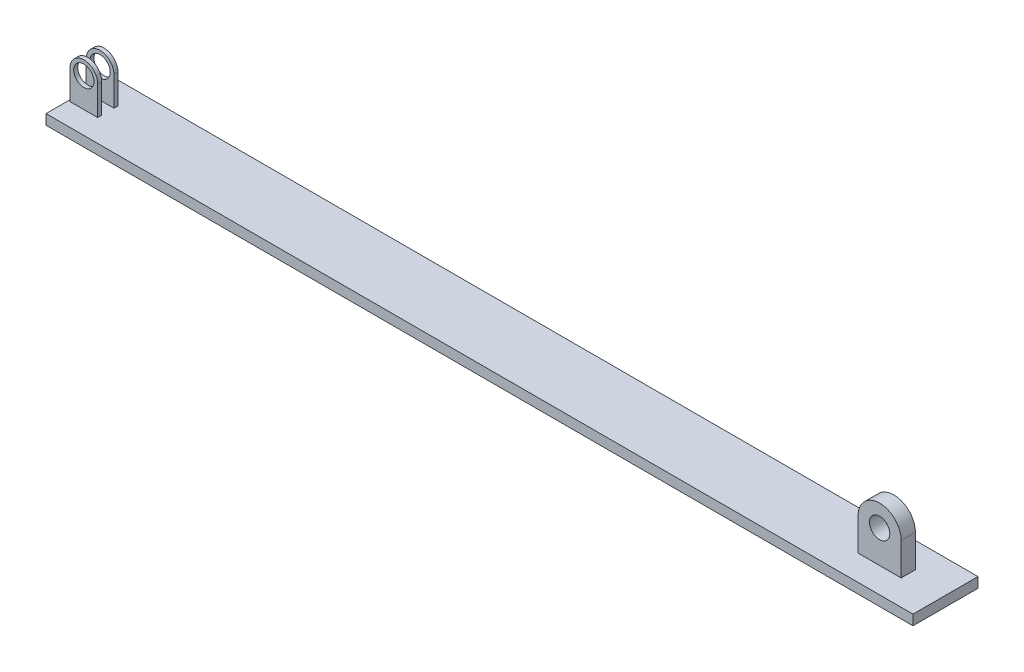
ISO-10303-21;
HEADER;
FILE_DESCRIPTION(('STEP AP214'),'2;1');
FILE_NAME('part.step','',(''),(''),'','','');
FILE_SCHEMA(('AUTOMOTIVE_DESIGN { 1 0 10303 214 1 1 1 1 }'));
ENDSEC;
DATA;
#1=APPLICATION_CONTEXT('core data for automotive mechanical design processes');
#2=APPLICATION_PROTOCOL_DEFINITION('international standard','automotive_design',2000,#1);
#3=PRODUCT_CONTEXT('',#1,'mechanical');
#4=PRODUCT('Part','Part','',(#3));
#5=PRODUCT_RELATED_PRODUCT_CATEGORY('part','',(#4));
#6=PRODUCT_DEFINITION_FORMATION('','',#4);
#7=PRODUCT_DEFINITION_CONTEXT('part definition',#1,'design');
#8=PRODUCT_DEFINITION('design','',#6,#7);
#9=PRODUCT_DEFINITION_SHAPE('','',#8);
#10=(LENGTH_UNIT() NAMED_UNIT(*) SI_UNIT(.MILLI.,.METRE.));
#11=(NAMED_UNIT(*) PLANE_ANGLE_UNIT() SI_UNIT($,.RADIAN.));
#12=(NAMED_UNIT(*) SI_UNIT($,.STERADIAN.) SOLID_ANGLE_UNIT());
#13=UNCERTAINTY_MEASURE_WITH_UNIT(LENGTH_MEASURE(1.E-05),#10,'distance_accuracy_value','');
#14=(GEOMETRIC_REPRESENTATION_CONTEXT(3) GLOBAL_UNCERTAINTY_ASSIGNED_CONTEXT((#13)) GLOBAL_UNIT_ASSIGNED_CONTEXT((#10,
#11,#12)) REPRESENTATION_CONTEXT('',''));
#15=CARTESIAN_POINT('',(0.,0.,0.));
#16=DIRECTION('',(0.,0.,1.));
#17=DIRECTION('',(1.,0.,0.));
#18=AXIS2_PLACEMENT_3D('',#15,#16,#17);
#19=CARTESIAN_POINT('',(0.,2.50000000000002,-16.));
#20=DIRECTION('',(0.,-1.,0.));
#21=DIRECTION('',(1.,0.,0.));
#22=AXIS2_PLACEMENT_3D('',#19,#20,#21);
#23=PLANE('',#22);
#24=DIRECTION('',(0.,0.,-1.));
#25=VECTOR('',#24,1.);
#26=CARTESIAN_POINT('',(14.4298921473095,2.50000000000002,5.));
#27=LINE('',#26,#25);
#28=CARTESIAN_POINT('',(14.4298921473095,2.50000000000002,5.));
#29=VERTEX_POINT('',#28);
#30=CARTESIAN_POINT('',(14.4298921473095,2.50000000000002,3.));
#31=VERTEX_POINT('',#30);
#32=EDGE_CURVE('E246',#29,#31,#27,.T.);
#33=ORIENTED_EDGE('',*,*,#32,.F.);
#34=DIRECTION('',(1.,0.,0.));
#35=VECTOR('',#34,1.);
#36=CARTESIAN_POINT('',(0.803073324079967,2.50000000000002,5.));
#37=LINE('',#36,#35);
#38=CARTESIAN_POINT('',(0.803073324079967,2.50000000000002,5.));
#39=VERTEX_POINT('',#38);
#40=EDGE_CURVE('E223',#39,#29,#37,.T.);
#41=ORIENTED_EDGE('',*,*,#40,.F.);
#42=DIRECTION('',(0.,0.,-1.));
#43=VECTOR('',#42,1.);
#44=CARTESIAN_POINT('',(0.803073324079967,2.50000000000002,5.));
#45=LINE('',#44,#43);
#46=CARTESIAN_POINT('',(0.803073324079967,2.50000000000002,3.));
#47=VERTEX_POINT('',#46);
#48=EDGE_CURVE('E234',#39,#47,#45,.T.);
#49=ORIENTED_EDGE('',*,*,#48,.T.);
#50=DIRECTION('',(-1.,0.,0.));
#51=VECTOR('',#50,1.);
#52=CARTESIAN_POINT('',(55.8620648864741,2.50000000000002,3.));
#53=LINE('',#52,#51);
#54=EDGE_CURVE('E188',#31,#47,#53,.T.);
#55=ORIENTED_EDGE('',*,*,#54,.F.);
#56=EDGE_LOOP('',(#33,#41,#49,#55));
#57=FACE_BOUND('',#56,.T.);
#58=DIRECTION('',(1.,0.,0.));
#59=VECTOR('',#58,1.);
#60=CARTESIAN_POINT('',(0.,2.50000000000002,16.));
#61=LINE('',#60,#59);
#62=CARTESIAN_POINT('',(0.,2.50000000000002,16.));
#63=VERTEX_POINT('',#62);
#64=CARTESIAN_POINT('',(426.72,2.49999999999993,16.));
#65=VERTEX_POINT('',#64);
#66=EDGE_CURVE('E252',#63,#65,#61,.T.);
#67=ORIENTED_EDGE('',*,*,#66,.T.);
#68=DIRECTION('',(0.,0.,1.));
#69=VECTOR('',#68,1.);
#70=CARTESIAN_POINT('',(426.72,2.49999999999993,-16.));
#71=LINE('',#70,#69);
#72=CARTESIAN_POINT('',(426.72,2.49999999999993,-16.));
#73=VERTEX_POINT('',#72);
#74=EDGE_CURVE('E41',#73,#65,#71,.T.);
#75=ORIENTED_EDGE('',*,*,#74,.F.);
#76=DIRECTION('',(1.,0.,0.));
#77=VECTOR('',#76,1.);
#78=CARTESIAN_POINT('',(0.,2.50000000000002,-16.));
#79=LINE('',#78,#77);
#80=CARTESIAN_POINT('',(0.,2.50000000000002,-16.));
#81=VERTEX_POINT('',#80);
#82=EDGE_CURVE('E261',#81,#73,#79,.T.);
#83=ORIENTED_EDGE('',*,*,#82,.F.);
#84=DIRECTION('',(0.,0.,1.));
#85=VECTOR('',#84,1.);
#86=CARTESIAN_POINT('',(0.,2.50000000000002,-16.));
#87=LINE('',#86,#85);
#88=EDGE_CURVE('E11',#81,#63,#87,.T.);
#89=ORIENTED_EDGE('',*,*,#88,.T.);
#90=EDGE_LOOP('',(#67,#75,#83,#89));
#91=FACE_BOUND('',#90,.T.);
#92=CARTESIAN_POINT('',(14.4298921473095,2.50000000000002,-3.));
#93=VERTEX_POINT('',#92);
#94=CARTESIAN_POINT('',(14.4298921473095,2.50000000000002,-5.));
#95=VERTEX_POINT('',#94);
#96=EDGE_CURVE('E245',#93,#95,#27,.T.);
#97=ORIENTED_EDGE('',*,*,#96,.F.);
#98=DIRECTION('',(-1.,0.,0.));
#99=VECTOR('',#98,1.);
#100=CARTESIAN_POINT('',(55.8620648864741,2.50000000000002,-3.));
#101=LINE('',#100,#99);
#102=CARTESIAN_POINT('',(0.803073324079967,2.50000000000002,-3.));
#103=VERTEX_POINT('',#102);
#104=EDGE_CURVE('E195',#93,#103,#101,.T.);
#105=ORIENTED_EDGE('',*,*,#104,.T.);
#106=CARTESIAN_POINT('',(0.803073324079967,2.50000000000002,-5.));
#107=VERTEX_POINT('',#106);
#108=EDGE_CURVE('E233',#103,#107,#45,.T.);
#109=ORIENTED_EDGE('',*,*,#108,.T.);
#110=DIRECTION('',(1.,0.,0.));
#111=VECTOR('',#110,1.);
#112=CARTESIAN_POINT('',(0.803073324079967,2.50000000000002,-5.));
#113=LINE('',#112,#111);
#114=EDGE_CURVE('E211',#107,#95,#113,.T.);
#115=ORIENTED_EDGE('',*,*,#114,.T.);
#116=EDGE_LOOP('',(#97,#105,#109,#115));
#117=FACE_BOUND('',#116,.T.);
#118=DIRECTION('',(0.,0.,-1.));
#119=VECTOR('',#118,1.);
#120=CARTESIAN_POINT('',(408.398633307808,2.50000000000002,3.5));
#121=LINE('',#120,#119);
#122=CARTESIAN_POINT('',(408.398633307808,2.49999999999994,3.5));
#123=VERTEX_POINT('',#122);
#124=CARTESIAN_POINT('',(408.398633307808,2.49999999999994,-3.5));
#125=VERTEX_POINT('',#124);
#126=EDGE_CURVE('E49',#123,#125,#121,.T.);
#127=ORIENTED_EDGE('',*,*,#126,.F.);
#128=DIRECTION('',(1.,0.,0.));
#129=VECTOR('',#128,1.);
#130=CARTESIAN_POINT('',(387.212680742163,2.50000000000002,3.5));
#131=LINE('',#130,#129);
#132=CARTESIAN_POINT('',(387.212680742163,2.50000000000002,3.5));
#133=VERTEX_POINT('',#132);
#134=EDGE_CURVE('E168',#133,#123,#131,.T.);
#135=ORIENTED_EDGE('',*,*,#134,.F.);
#136=DIRECTION('',(0.,0.,-1.));
#137=VECTOR('',#136,1.);
#138=CARTESIAN_POINT('',(387.212680742163,2.50000000000002,3.5));
#139=LINE('',#138,#137);
#140=CARTESIAN_POINT('',(387.212680742163,2.49999999999994,-3.5));
#141=VERTEX_POINT('',#140);
#142=EDGE_CURVE('E180',#133,#141,#139,.T.);
#143=ORIENTED_EDGE('',*,*,#142,.T.);
#144=DIRECTION('',(1.,0.,0.));
#145=VECTOR('',#144,1.);
#146=CARTESIAN_POINT('',(387.212680742163,2.50000000000002,-3.5));
#147=LINE('',#146,#145);
#148=EDGE_CURVE('E54',#141,#125,#147,.T.);
#149=ORIENTED_EDGE('',*,*,#148,.T.);
#150=EDGE_LOOP('',(#127,#135,#143,#149));
#151=FACE_BOUND('',#150,.T.);
#152=ADVANCED_FACE('F32',(#57,#91,#117,#151),#23,.F.);
#153=CARTESIAN_POINT('',(14.4298921473095,2.50000000000002,5.));
#154=DIRECTION('',(-1.,0.,0.));
#155=DIRECTION('',(0.,0.,1.));
#156=AXIS2_PLACEMENT_3D('',#153,#154,#155);
#157=PLANE('',#156);
#158=DIRECTION('',(0.,0.,-1.));
#159=VECTOR('',#158,1.);
#160=CARTESIAN_POINT('',(14.4298921473095,16.9215035060392,5.));
#161=LINE('',#160,#159);
#162=CARTESIAN_POINT('',(14.4298921473095,16.9215035060392,-3.));
#163=VERTEX_POINT('',#162);
#164=CARTESIAN_POINT('',(14.4298921473095,16.9215035060392,-5.));
#165=VERTEX_POINT('',#164);
#166=EDGE_CURVE('E241',#163,#165,#161,.T.);
#167=ORIENTED_EDGE('',*,*,#166,.F.);
#168=DIRECTION('',(0.,1.,0.));
#169=VECTOR('',#168,1.);
#170=CARTESIAN_POINT('',(14.4298921473095,2.50000000000002,-3.));
#171=LINE('',#170,#169);
#172=EDGE_CURVE('E187',#93,#163,#171,.T.);
#173=ORIENTED_EDGE('',*,*,#172,.F.);
#174=ORIENTED_EDGE('',*,*,#96,.T.);
#175=DIRECTION('',(0.,1.,0.));
#176=VECTOR('',#175,1.);
#177=CARTESIAN_POINT('',(14.4298921473095,2.50000000000002,-5.));
#178=LINE('',#177,#176);
#179=EDGE_CURVE('E214',#95,#165,#178,.T.);
#180=ORIENTED_EDGE('',*,*,#179,.T.);
#181=EDGE_LOOP('',(#167,#173,#174,#180));
#182=FACE_BOUND('',#181,.T.);
#183=ADVANCED_FACE('F307',(#182),#157,.F.);
#184=CARTESIAN_POINT('',(7.61648273569473,16.9215035060392,5.));
#185=DIRECTION('',(0.,0.,-1.));
#186=DIRECTION('',(-1.,0.,0.));
#187=AXIS2_PLACEMENT_3D('',#184,#185,#186);
#188=CYLINDRICAL_SURFACE('',#187,6.81340941161476);
#189=DIRECTION('',(0.,0.,-1.));
#190=VECTOR('',#189,1.);
#191=CARTESIAN_POINT('',(0.803073324079967,16.9215035060392,5.));
#192=LINE('',#191,#190);
#193=CARTESIAN_POINT('',(0.803073324079967,16.9215035060392,-3.));
#194=VERTEX_POINT('',#193);
#195=CARTESIAN_POINT('',(0.803073324079967,16.9215035060392,-5.));
#196=VERTEX_POINT('',#195);
#197=EDGE_CURVE('E237',#194,#196,#192,.T.);
#198=ORIENTED_EDGE('',*,*,#197,.F.);
#199=CARTESIAN_POINT('',(7.61648273569473,16.9215035060392,-3.));
#200=DIRECTION('',(0.,0.,-1.));
#201=DIRECTION('',(0.,1.,0.));
#202=AXIS2_PLACEMENT_3D('',#199,#200,#201);
#203=CIRCLE('',#202,6.81340941161476);
#204=EDGE_CURVE('E201',#194,#163,#203,.T.);
#205=ORIENTED_EDGE('',*,*,#204,.T.);
#206=ORIENTED_EDGE('',*,*,#166,.T.);
#207=CARTESIAN_POINT('',(7.61648273569473,16.9215035060392,-5.));
#208=DIRECTION('',(0.,0.,1.));
#209=DIRECTION('',(-1.,0.,0.));
#210=AXIS2_PLACEMENT_3D('',#207,#208,#209);
#211=CIRCLE('',#210,6.81340941161476);
#212=EDGE_CURVE('E217',#165,#196,#211,.T.);
#213=ORIENTED_EDGE('',*,*,#212,.T.);
#214=EDGE_LOOP('',(#198,#205,#206,#213));
#215=FACE_BOUND('',#214,.T.);
#216=ADVANCED_FACE('F312',(#215),#188,.T.);
#217=CARTESIAN_POINT('',(0.803073324079967,2.50000000000002,5.));
#218=DIRECTION('',(1.,0.,0.));
#219=DIRECTION('',(0.,0.,-1.));
#220=AXIS2_PLACEMENT_3D('',#217,#218,#219);
#221=PLANE('',#220);
#222=ORIENTED_EDGE('',*,*,#108,.F.);
#223=DIRECTION('',(0.,-1.,0.));
#224=VECTOR('',#223,1.);
#225=CARTESIAN_POINT('',(0.803073324079967,2.50000000000002,-3.));
#226=LINE('',#225,#224);
#227=EDGE_CURVE('E184',#194,#103,#226,.T.);
#228=ORIENTED_EDGE('',*,*,#227,.F.);
#229=ORIENTED_EDGE('',*,*,#197,.T.);
#230=DIRECTION('',(0.,-1.,0.));
#231=VECTOR('',#230,1.);
#232=CARTESIAN_POINT('',(0.803073324079967,2.50000000000002,-5.));
#233=LINE('',#232,#231);
#234=EDGE_CURVE('E220',#196,#107,#233,.T.);
#235=ORIENTED_EDGE('',*,*,#234,.T.);
#236=EDGE_LOOP('',(#222,#228,#229,#235));
#237=FACE_BOUND('',#236,.T.);
#238=ADVANCED_FACE('F335',(#237),#221,.F.);
#239=CARTESIAN_POINT('',(7.61648273569473,16.9215035060392,5.));
#240=DIRECTION('',(0.,0.,-1.));
#241=DIRECTION('',(-1.,0.,0.));
#242=AXIS2_PLACEMENT_3D('',#239,#240,#241);
#243=CYLINDRICAL_SURFACE('',#242,5.);
#244=CARTESIAN_POINT('',(7.61648273569473,16.9215035060392,-3.));
#245=DIRECTION('',(0.,0.,-1.));
#246=DIRECTION('',(0.,1.,0.));
#247=AXIS2_PLACEMENT_3D('',#244,#245,#246);
#248=CIRCLE('',#247,5.);
#249=CARTESIAN_POINT('',(7.61648273569473,21.9215035060392,-3.));
#250=VERTEX_POINT('',#249);
#251=EDGE_CURVE('E36',#250,#250,#248,.T.);
#252=ORIENTED_EDGE('',*,*,#251,.F.);
#253=EDGE_LOOP('',(#252));
#254=FACE_BOUND('',#253,.T.);
#255=CARTESIAN_POINT('',(7.61648273569473,16.9215035060392,-5.));
#256=DIRECTION('',(0.,0.,1.));
#257=DIRECTION('',(1.,0.,0.));
#258=AXIS2_PLACEMENT_3D('',#255,#256,#257);
#259=CIRCLE('',#258,5.);
#260=CARTESIAN_POINT('',(12.6164827356947,16.9215035060392,-5.));
#261=VERTEX_POINT('',#260);
#262=EDGE_CURVE('E204',#261,#261,#259,.T.);
#263=ORIENTED_EDGE('',*,*,#262,.F.);
#264=EDGE_LOOP('',(#263));
#265=FACE_BOUND('',#264,.T.);
#266=ADVANCED_FACE('F286',(#254,#265),#243,.F.);
#267=CARTESIAN_POINT('',(0.,-2.49999999999998,-16.));
#268=DIRECTION('',(1.,0.,0.));
#269=DIRECTION('',(0.,1.,0.));
#270=AXIS2_PLACEMENT_3D('',#267,#268,#269);
#271=PLANE('',#270);
#272=DIRECTION('',(0.,1.,0.));
#273=VECTOR('',#272,1.);
#274=CARTESIAN_POINT('',(0.,-2.49999999999998,16.));
#275=LINE('',#274,#273);
#276=CARTESIAN_POINT('',(0.,-2.49999999999998,16.));
#277=VERTEX_POINT('',#276);
#278=EDGE_CURVE('E249',#277,#63,#275,.T.);
#279=ORIENTED_EDGE('',*,*,#278,.T.);
#280=ORIENTED_EDGE('',*,*,#88,.F.);
#281=DIRECTION('',(0.,1.,0.));
#282=VECTOR('',#281,1.);
#283=CARTESIAN_POINT('',(0.,-2.49999999999998,-16.));
#284=LINE('',#283,#282);
#285=CARTESIAN_POINT('',(0.,-2.49999999999998,-16.));
#286=VERTEX_POINT('',#285);
#287=EDGE_CURVE('E258',#286,#81,#284,.T.);
#288=ORIENTED_EDGE('',*,*,#287,.F.);
#289=DIRECTION('',(0.,0.,1.));
#290=VECTOR('',#289,1.);
#291=CARTESIAN_POINT('',(0.,-2.49999999999998,-16.));
#292=LINE('',#291,#290);
#293=EDGE_CURVE('E267',#286,#277,#292,.T.);
#294=ORIENTED_EDGE('',*,*,#293,.T.);
#295=EDGE_LOOP('',(#279,#280,#288,#294));
#296=FACE_BOUND('',#295,.T.);
#297=ADVANCED_FACE('F34',(#296),#271,.F.);
#298=CARTESIAN_POINT('',(426.72,-2.49999999999996,-16.));
#299=DIRECTION('',(-1.,0.,0.));
#300=DIRECTION('',(0.,0.,1.));
#301=AXIS2_PLACEMENT_3D('',#298,#299,#300);
#302=PLANE('',#301);
#303=DIRECTION('',(0.,-1.,0.));
#304=VECTOR('',#303,1.);
#305=CARTESIAN_POINT('',(426.72,-2.49999999999996,16.));
#306=LINE('',#305,#304);
#307=CARTESIAN_POINT('',(426.72,-2.49999999999996,16.));
#308=VERTEX_POINT('',#307);
#309=EDGE_CURVE('E254',#65,#308,#306,.T.);
#310=ORIENTED_EDGE('',*,*,#309,.T.);
#311=DIRECTION('',(0.,0.,1.));
#312=VECTOR('',#311,1.);
#313=CARTESIAN_POINT('',(426.72,-2.49999999999996,-16.));
#314=LINE('',#313,#312);
#315=CARTESIAN_POINT('',(426.72,-2.49999999999996,-16.));
#316=VERTEX_POINT('',#315);
#317=EDGE_CURVE('E270',#316,#308,#314,.T.);
#318=ORIENTED_EDGE('',*,*,#317,.F.);
#319=DIRECTION('',(0.,-1.,0.));
#320=VECTOR('',#319,1.);
#321=CARTESIAN_POINT('',(426.72,-2.49999999999996,-16.));
#322=LINE('',#321,#320);
#323=EDGE_CURVE('E263',#73,#316,#322,.T.);
#324=ORIENTED_EDGE('',*,*,#323,.F.);
#325=ORIENTED_EDGE('',*,*,#74,.T.);
#326=EDGE_LOOP('',(#310,#318,#324,#325));
#327=FACE_BOUND('',#326,.T.);
#328=ADVANCED_FACE('F317',(#327),#302,.F.);
#329=CARTESIAN_POINT('',(0.,-2.49999999999998,-16.));
#330=DIRECTION('',(0.,1.,0.));
#331=DIRECTION('',(-1.,0.,0.));
#332=AXIS2_PLACEMENT_3D('',#329,#330,#331);
#333=PLANE('',#332);
#334=DIRECTION('',(-1.,0.,0.));
#335=VECTOR('',#334,1.);
#336=CARTESIAN_POINT('',(0.,-2.49999999999998,16.));
#337=LINE('',#336,#335);
#338=EDGE_CURVE('E256',#308,#277,#337,.T.);
#339=ORIENTED_EDGE('',*,*,#338,.T.);
#340=ORIENTED_EDGE('',*,*,#293,.F.);
#341=DIRECTION('',(-1.,0.,0.));
#342=VECTOR('',#341,1.);
#343=CARTESIAN_POINT('',(0.,-2.49999999999998,-16.));
#344=LINE('',#343,#342);
#345=EDGE_CURVE('E265',#316,#286,#344,.T.);
#346=ORIENTED_EDGE('',*,*,#345,.F.);
#347=ORIENTED_EDGE('',*,*,#317,.T.);
#348=EDGE_LOOP('',(#339,#340,#346,#347));
#349=FACE_BOUND('',#348,.T.);
#350=ADVANCED_FACE('F320',(#349),#333,.F.);
#351=CARTESIAN_POINT('',(0.,2.50000000000002,-16.));
#352=DIRECTION('',(0.,0.,-1.));
#353=DIRECTION('',(-1.,0.,0.));
#354=AXIS2_PLACEMENT_3D('',#351,#352,#353);
#355=PLANE('',#354);
#356=ORIENTED_EDGE('',*,*,#287,.T.);
#357=ORIENTED_EDGE('',*,*,#82,.T.);
#358=ORIENTED_EDGE('',*,*,#323,.T.);
#359=ORIENTED_EDGE('',*,*,#345,.T.);
#360=EDGE_LOOP('',(#356,#357,#358,#359));
#361=FACE_BOUND('',#360,.T.);
#362=ADVANCED_FACE('F302',(#361),#355,.T.);
#363=CARTESIAN_POINT('',(0.,2.50000000000002,16.));
#364=DIRECTION('',(0.,0.,-1.));
#365=DIRECTION('',(-1.,0.,0.));
#366=AXIS2_PLACEMENT_3D('',#363,#364,#365);
#367=PLANE('',#366);
#368=ORIENTED_EDGE('',*,*,#278,.F.);
#369=ORIENTED_EDGE('',*,*,#338,.F.);
#370=ORIENTED_EDGE('',*,*,#309,.F.);
#371=ORIENTED_EDGE('',*,*,#66,.F.);
#372=EDGE_LOOP('',(#368,#369,#370,#371));
#373=FACE_BOUND('',#372,.T.);
#374=ADVANCED_FACE('F292',(#373),#367,.F.);
#375=CARTESIAN_POINT('',(7.61648273569473,16.9215035060392,5.));
#376=DIRECTION('',(0.,0.,-1.));
#377=DIRECTION('',(-1.,0.,0.));
#378=AXIS2_PLACEMENT_3D('',#375,#376,#377);
#379=PLANE('',#378);
#380=ORIENTED_EDGE('',*,*,#40,.T.);
#381=DIRECTION('',(0.,1.,0.));
#382=VECTOR('',#381,1.);
#383=CARTESIAN_POINT('',(14.4298921473095,2.50000000000002,5.));
#384=LINE('',#383,#382);
#385=CARTESIAN_POINT('',(14.4298921473095,16.9215035060392,5.));
#386=VERTEX_POINT('',#385);
#387=EDGE_CURVE('E226',#29,#386,#384,.T.);
#388=ORIENTED_EDGE('',*,*,#387,.T.);
#389=CARTESIAN_POINT('',(7.61648273569473,16.9215035060392,5.));
#390=DIRECTION('',(0.,0.,1.));
#391=DIRECTION('',(-1.,0.,0.));
#392=AXIS2_PLACEMENT_3D('',#389,#390,#391);
#393=CIRCLE('',#392,6.81340941161476);
#394=CARTESIAN_POINT('',(0.803073324079967,16.9215035060392,5.));
#395=VERTEX_POINT('',#394);
#396=EDGE_CURVE('E228',#386,#395,#393,.T.);
#397=ORIENTED_EDGE('',*,*,#396,.T.);
#398=DIRECTION('',(0.,-1.,0.));
#399=VECTOR('',#398,1.);
#400=CARTESIAN_POINT('',(0.803073324079967,2.50000000000002,5.));
#401=LINE('',#400,#399);
#402=EDGE_CURVE('E230',#395,#39,#401,.T.);
#403=ORIENTED_EDGE('',*,*,#402,.T.);
#404=EDGE_LOOP('',(#380,#388,#397,#403));
#405=FACE_BOUND('',#404,.T.);
#406=CARTESIAN_POINT('',(7.61648273569473,16.9215035060392,5.));
#407=DIRECTION('',(0.,0.,1.));
#408=DIRECTION('',(1.,0.,0.));
#409=AXIS2_PLACEMENT_3D('',#406,#407,#408);
#410=CIRCLE('',#409,5.);
#411=CARTESIAN_POINT('',(12.6164827356947,16.9215035060392,5.));
#412=VERTEX_POINT('',#411);
#413=EDGE_CURVE('E207',#412,#412,#410,.T.);
#414=ORIENTED_EDGE('',*,*,#413,.F.);
#415=EDGE_LOOP('',(#414));
#416=FACE_BOUND('',#415,.T.);
#417=ADVANCED_FACE('F289',(#405,#416),#379,.F.);
#418=CARTESIAN_POINT('',(7.61648273569473,16.9215035060392,-5.));
#419=DIRECTION('',(0.,0.,-1.));
#420=DIRECTION('',(-1.,0.,0.));
#421=AXIS2_PLACEMENT_3D('',#418,#419,#420);
#422=PLANE('',#421);
#423=ORIENTED_EDGE('',*,*,#114,.F.);
#424=ORIENTED_EDGE('',*,*,#234,.F.);
#425=ORIENTED_EDGE('',*,*,#212,.F.);
#426=ORIENTED_EDGE('',*,*,#179,.F.);
#427=EDGE_LOOP('',(#423,#424,#425,#426));
#428=FACE_BOUND('',#427,.T.);
#429=ORIENTED_EDGE('',*,*,#262,.T.);
#430=EDGE_LOOP('',(#429));
#431=FACE_BOUND('',#430,.T.);
#432=ADVANCED_FACE('F291',(#428,#431),#422,.T.);
#433=ORIENTED_EDGE('',*,*,#32,.T.);
#434=DIRECTION('',(0.,-1.,0.));
#435=VECTOR('',#434,1.);
#436=CARTESIAN_POINT('',(14.4298921473095,2.50000000000002,3.));
#437=LINE('',#436,#435);
#438=CARTESIAN_POINT('',(14.4298921473095,16.9215035060392,3.));
#439=VERTEX_POINT('',#438);
#440=EDGE_CURVE('E185',#439,#31,#437,.T.);
#441=ORIENTED_EDGE('',*,*,#440,.F.);
#442=EDGE_CURVE('E242',#386,#439,#161,.T.);
#443=ORIENTED_EDGE('',*,*,#442,.F.);
#444=ORIENTED_EDGE('',*,*,#387,.F.);
#445=EDGE_LOOP('',(#433,#441,#443,#444));
#446=FACE_BOUND('',#445,.T.);
#447=ADVANCED_FACE('F299',(#446),#157,.F.);
#448=ORIENTED_EDGE('',*,*,#442,.T.);
#449=CARTESIAN_POINT('',(7.61648273569473,16.9215035060392,3.));
#450=DIRECTION('',(0.,0.,1.));
#451=DIRECTION('',(0.,-1.,0.));
#452=AXIS2_PLACEMENT_3D('',#449,#450,#451);
#453=CIRCLE('',#452,6.81340941161476);
#454=CARTESIAN_POINT('',(0.803073324079967,16.9215035060392,3.));
#455=VERTEX_POINT('',#454);
#456=EDGE_CURVE('E198',#439,#455,#453,.T.);
#457=ORIENTED_EDGE('',*,*,#456,.T.);
#458=EDGE_CURVE('E238',#395,#455,#192,.T.);
#459=ORIENTED_EDGE('',*,*,#458,.F.);
#460=ORIENTED_EDGE('',*,*,#396,.F.);
#461=EDGE_LOOP('',(#448,#457,#459,#460));
#462=FACE_BOUND('',#461,.T.);
#463=ADVANCED_FACE('F329',(#462),#188,.T.);
#464=ORIENTED_EDGE('',*,*,#458,.T.);
#465=DIRECTION('',(0.,1.,0.));
#466=VECTOR('',#465,1.);
#467=CARTESIAN_POINT('',(0.803073324079967,2.50000000000002,3.));
#468=LINE('',#467,#466);
#469=EDGE_CURVE('E193',#47,#455,#468,.T.);
#470=ORIENTED_EDGE('',*,*,#469,.F.);
#471=ORIENTED_EDGE('',*,*,#48,.F.);
#472=ORIENTED_EDGE('',*,*,#402,.F.);
#473=EDGE_LOOP('',(#464,#470,#471,#472));
#474=FACE_BOUND('',#473,.T.);
#475=ADVANCED_FACE('F284',(#474),#221,.F.);
#476=CARTESIAN_POINT('',(7.61648273569473,16.9215035060392,3.));
#477=DIRECTION('',(0.,0.,1.));
#478=DIRECTION('',(0.,-1.,0.));
#479=AXIS2_PLACEMENT_3D('',#476,#477,#478);
#480=CIRCLE('',#479,5.);
#481=CARTESIAN_POINT('',(7.61648273569473,11.9215035060392,3.));
#482=VERTEX_POINT('',#481);
#483=EDGE_CURVE('E190',#482,#482,#480,.T.);
#484=ORIENTED_EDGE('',*,*,#483,.F.);
#485=EDGE_LOOP('',(#484));
#486=FACE_BOUND('',#485,.T.);
#487=ORIENTED_EDGE('',*,*,#413,.T.);
#488=EDGE_LOOP('',(#487));
#489=FACE_BOUND('',#488,.T.);
#490=ADVANCED_FACE('F280',(#486,#489),#243,.F.);
#491=CARTESIAN_POINT('',(55.8620648864741,2.50000000000002,-3.));
#492=DIRECTION('',(0.,0.,-1.));
#493=DIRECTION('',(0.,1.,0.));
#494=AXIS2_PLACEMENT_3D('',#491,#492,#493);
#495=PLANE('',#494);
#496=ORIENTED_EDGE('',*,*,#251,.T.);
#497=EDGE_LOOP('',(#496));
#498=FACE_BOUND('',#497,.T.);
#499=ORIENTED_EDGE('',*,*,#227,.T.);
#500=ORIENTED_EDGE('',*,*,#104,.F.);
#501=ORIENTED_EDGE('',*,*,#172,.T.);
#502=ORIENTED_EDGE('',*,*,#204,.F.);
#503=EDGE_LOOP('',(#499,#500,#501,#502));
#504=FACE_BOUND('',#503,.T.);
#505=ADVANCED_FACE('F283',(#498,#504),#495,.F.);
#506=CARTESIAN_POINT('',(55.8620648864741,2.50000000000002,3.));
#507=DIRECTION('',(0.,0.,1.));
#508=DIRECTION('',(0.,-1.,0.));
#509=AXIS2_PLACEMENT_3D('',#506,#507,#508);
#510=PLANE('',#509);
#511=ORIENTED_EDGE('',*,*,#483,.T.);
#512=EDGE_LOOP('',(#511));
#513=FACE_BOUND('',#512,.T.);
#514=ORIENTED_EDGE('',*,*,#440,.T.);
#515=ORIENTED_EDGE('',*,*,#54,.T.);
#516=ORIENTED_EDGE('',*,*,#469,.T.);
#517=ORIENTED_EDGE('',*,*,#456,.F.);
#518=EDGE_LOOP('',(#514,#515,#516,#517));
#519=FACE_BOUND('',#518,.T.);
#520=ADVANCED_FACE('F277',(#513,#519),#510,.F.);
#521=CARTESIAN_POINT('',(397.805657024986,18.5157466895125,3.5));
#522=DIRECTION('',(0.,0.,1.));
#523=DIRECTION('',(1.,0.,0.));
#524=AXIS2_PLACEMENT_3D('',#521,#522,#523);
#525=PLANE('',#524);
#526=ORIENTED_EDGE('',*,*,#134,.T.);
#527=DIRECTION('',(0.,1.,0.));
#528=VECTOR('',#527,1.);
#529=CARTESIAN_POINT('',(408.398633307808,2.50000000000002,3.5));
#530=LINE('',#529,#528);
#531=CARTESIAN_POINT('',(408.398633307808,18.5157466895125,3.5));
#532=VERTEX_POINT('',#531);
#533=EDGE_CURVE('E174',#123,#532,#530,.T.);
#534=ORIENTED_EDGE('',*,*,#533,.T.);
#535=CARTESIAN_POINT('',(397.805657024986,18.5157466895125,3.5));
#536=DIRECTION('',(0.,0.,1.));
#537=DIRECTION('',(1.,0.,0.));
#538=AXIS2_PLACEMENT_3D('',#535,#536,#537);
#539=CIRCLE('',#538,10.5929762828229);
#540=CARTESIAN_POINT('',(387.212680742163,18.5157466895125,3.5));
#541=VERTEX_POINT('',#540);
#542=EDGE_CURVE('E159',#532,#541,#539,.T.);
#543=ORIENTED_EDGE('',*,*,#542,.T.);
#544=DIRECTION('',(0.,-1.,0.));
#545=VECTOR('',#544,1.);
#546=CARTESIAN_POINT('',(387.212680742163,2.50000000000002,3.5));
#547=LINE('',#546,#545);
#548=EDGE_CURVE('E177',#541,#133,#547,.T.);
#549=ORIENTED_EDGE('',*,*,#548,.T.);
#550=EDGE_LOOP('',(#526,#534,#543,#549));
#551=FACE_BOUND('',#550,.T.);
#552=CARTESIAN_POINT('',(397.805657024986,18.5157466895125,3.5));
#553=DIRECTION('',(0.,0.,1.));
#554=DIRECTION('',(1.,0.,0.));
#555=AXIS2_PLACEMENT_3D('',#552,#553,#554);
#556=CIRCLE('',#555,4.99999999999999);
#557=CARTESIAN_POINT('',(402.805657024986,18.5157466895125,3.5));
#558=VERTEX_POINT('',#557);
#559=EDGE_CURVE('E392',#558,#558,#556,.T.);
#560=ORIENTED_EDGE('',*,*,#559,.F.);
#561=EDGE_LOOP('',(#560));
#562=FACE_BOUND('',#561,.T.);
#563=ADVANCED_FACE('F367',(#551,#562),#525,.T.);
#564=CARTESIAN_POINT('',(397.805657024986,18.5157466895125,-3.5));
#565=DIRECTION('',(0.,0.,1.));
#566=DIRECTION('',(1.,0.,0.));
#567=AXIS2_PLACEMENT_3D('',#564,#565,#566);
#568=PLANE('',#567);
#569=ORIENTED_EDGE('',*,*,#148,.F.);
#570=DIRECTION('',(0.,-1.,0.));
#571=VECTOR('',#570,1.);
#572=CARTESIAN_POINT('',(387.212680742163,2.50000000000002,-3.5));
#573=LINE('',#572,#571);
#574=CARTESIAN_POINT('',(387.212680742163,18.5157466895125,-3.5));
#575=VERTEX_POINT('',#574);
#576=EDGE_CURVE('E166',#575,#141,#573,.T.);
#577=ORIENTED_EDGE('',*,*,#576,.F.);
#578=CARTESIAN_POINT('',(397.805657024986,18.5157466895125,-3.5));
#579=DIRECTION('',(0.,0.,1.));
#580=DIRECTION('',(1.,0.,0.));
#581=AXIS2_PLACEMENT_3D('',#578,#579,#580);
#582=CIRCLE('',#581,10.5929762828229);
#583=CARTESIAN_POINT('',(408.398633307808,18.5157466895125,-3.5));
#584=VERTEX_POINT('',#583);
#585=EDGE_CURVE('E153',#584,#575,#582,.T.);
#586=ORIENTED_EDGE('',*,*,#585,.F.);
#587=DIRECTION('',(0.,1.,0.));
#588=VECTOR('',#587,1.);
#589=CARTESIAN_POINT('',(408.398633307808,2.50000000000002,-3.5));
#590=LINE('',#589,#588);
#591=EDGE_CURVE('E146',#125,#584,#590,.T.);
#592=ORIENTED_EDGE('',*,*,#591,.F.);
#593=EDGE_LOOP('',(#569,#577,#586,#592));
#594=FACE_BOUND('',#593,.T.);
#595=CARTESIAN_POINT('',(397.805657024986,18.5157466895125,-3.5));
#596=DIRECTION('',(0.,0.,1.));
#597=DIRECTION('',(1.,0.,0.));
#598=AXIS2_PLACEMENT_3D('',#595,#596,#597);
#599=CIRCLE('',#598,4.99999999999999);
#600=CARTESIAN_POINT('',(402.805657024986,18.5157466895125,-3.5));
#601=VERTEX_POINT('',#600);
#602=EDGE_CURVE('E395',#601,#601,#599,.T.);
#603=ORIENTED_EDGE('',*,*,#602,.T.);
#604=EDGE_LOOP('',(#603));
#605=FACE_BOUND('',#604,.T.);
#606=ADVANCED_FACE('F163',(#594,#605),#568,.F.);
#607=CARTESIAN_POINT('',(408.398633307808,2.50000000000002,3.5));
#608=DIRECTION('',(-1.,0.,0.));
#609=DIRECTION('',(0.,0.,1.));
#610=AXIS2_PLACEMENT_3D('',#607,#608,#609);
#611=PLANE('',#610);
#612=ORIENTED_EDGE('',*,*,#591,.T.);
#613=DIRECTION('',(0.,0.,-1.));
#614=VECTOR('',#613,1.);
#615=CARTESIAN_POINT('',(408.398633307808,18.5157466895125,3.5));
#616=LINE('',#615,#614);
#617=EDGE_CURVE('E149',#532,#584,#616,.T.);
#618=ORIENTED_EDGE('',*,*,#617,.F.);
#619=ORIENTED_EDGE('',*,*,#533,.F.);
#620=ORIENTED_EDGE('',*,*,#126,.T.);
#621=EDGE_LOOP('',(#612,#618,#619,#620));
#622=FACE_BOUND('',#621,.T.);
#623=ADVANCED_FACE('F148',(#622),#611,.F.);
#624=CARTESIAN_POINT('',(397.805657024986,18.5157466895125,3.5));
#625=DIRECTION('',(0.,0.,-1.));
#626=DIRECTION('',(-1.,0.,0.));
#627=AXIS2_PLACEMENT_3D('',#624,#625,#626);
#628=CYLINDRICAL_SURFACE('',#627,10.5929762828229);
#629=ORIENTED_EDGE('',*,*,#585,.T.);
#630=DIRECTION('',(0.,0.,-1.));
#631=VECTOR('',#630,1.);
#632=CARTESIAN_POINT('',(387.212680742163,18.5157466895125,3.5));
#633=LINE('',#632,#631);
#634=EDGE_CURVE('E160',#541,#575,#633,.T.);
#635=ORIENTED_EDGE('',*,*,#634,.F.);
#636=ORIENTED_EDGE('',*,*,#542,.F.);
#637=ORIENTED_EDGE('',*,*,#617,.T.);
#638=EDGE_LOOP('',(#629,#635,#636,#637));
#639=FACE_BOUND('',#638,.T.);
#640=ADVANCED_FACE('F156',(#639),#628,.T.);
#641=CARTESIAN_POINT('',(387.212680742163,2.50000000000002,3.5));
#642=DIRECTION('',(1.,0.,0.));
#643=DIRECTION('',(0.,0.,-1.));
#644=AXIS2_PLACEMENT_3D('',#641,#642,#643);
#645=PLANE('',#644);
#646=ORIENTED_EDGE('',*,*,#576,.T.);
#647=ORIENTED_EDGE('',*,*,#142,.F.);
#648=ORIENTED_EDGE('',*,*,#548,.F.);
#649=ORIENTED_EDGE('',*,*,#634,.T.);
#650=EDGE_LOOP('',(#646,#647,#648,#649));
#651=FACE_BOUND('',#650,.T.);
#652=ADVANCED_FACE('F375',(#651),#645,.F.);
#653=CARTESIAN_POINT('',(397.805657024986,18.5157466895125,3.5));
#654=DIRECTION('',(0.,0.,-1.));
#655=DIRECTION('',(-1.,0.,0.));
#656=AXIS2_PLACEMENT_3D('',#653,#654,#655);
#657=CYLINDRICAL_SURFACE('',#656,4.99999999999999);
#658=ORIENTED_EDGE('',*,*,#559,.T.);
#659=EDGE_LOOP('',(#658));
#660=FACE_BOUND('',#659,.T.);
#661=ORIENTED_EDGE('',*,*,#602,.F.);
#662=EDGE_LOOP('',(#661));
#663=FACE_BOUND('',#662,.T.);
#664=ADVANCED_FACE('F378',(#660,#663),#657,.F.);
#665=CLOSED_SHELL('',(#152,#183,#216,#238,#266,#297,#328,#350,#362,#374,#417,#432,#447,#463,
#475,#490,#505,#520,#563,#606,#623,#640,#652,#664));
#666=MANIFOLD_SOLID_BREP('B2',#665);
#667=ADVANCED_BREP_SHAPE_REPRESENTATION('',(#18,#666),#14);
#668=SHAPE_DEFINITION_REPRESENTATION(#9,#667);
ENDSEC;
END-ISO-10303-21;
